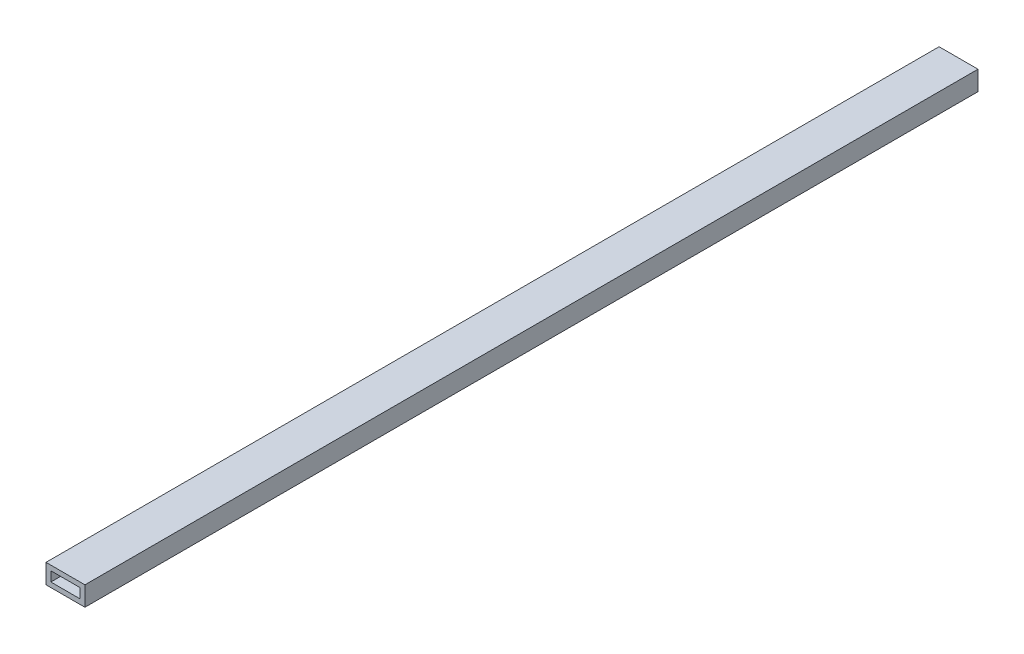
ISO-10303-21;
HEADER;
FILE_DESCRIPTION(('STEP AP214'),'2;1');
FILE_NAME('part.step','',(''),(''),'','','');
FILE_SCHEMA(('AUTOMOTIVE_DESIGN { 1 0 10303 214 1 1 1 1 }'));
ENDSEC;
DATA;
#1=APPLICATION_CONTEXT('core data for automotive mechanical design processes');
#2=APPLICATION_PROTOCOL_DEFINITION('international standard','automotive_design',2000,#1);
#3=PRODUCT_CONTEXT('',#1,'mechanical');
#4=PRODUCT('Part','Part','',(#3));
#5=PRODUCT_RELATED_PRODUCT_CATEGORY('part','',(#4));
#6=PRODUCT_DEFINITION_FORMATION('','',#4);
#7=PRODUCT_DEFINITION_CONTEXT('part definition',#1,'design');
#8=PRODUCT_DEFINITION('design','',#6,#7);
#9=PRODUCT_DEFINITION_SHAPE('','',#8);
#10=(LENGTH_UNIT() NAMED_UNIT(*) SI_UNIT(.MILLI.,.METRE.));
#11=(NAMED_UNIT(*) PLANE_ANGLE_UNIT() SI_UNIT($,.RADIAN.));
#12=(NAMED_UNIT(*) SI_UNIT($,.STERADIAN.) SOLID_ANGLE_UNIT());
#13=UNCERTAINTY_MEASURE_WITH_UNIT(LENGTH_MEASURE(1.E-05),#10,'distance_accuracy_value','');
#14=(GEOMETRIC_REPRESENTATION_CONTEXT(3) GLOBAL_UNCERTAINTY_ASSIGNED_CONTEXT((#13)) GLOBAL_UNIT_ASSIGNED_CONTEXT((#10,
#11,#12)) REPRESENTATION_CONTEXT('',''));
#15=CARTESIAN_POINT('',(0.,0.,0.));
#16=DIRECTION('',(0.,0.,1.));
#17=DIRECTION('',(1.,0.,0.));
#18=AXIS2_PLACEMENT_3D('',#15,#16,#17);
#19=CARTESIAN_POINT('',(-25.284193342889,14.9139194139194,582.676));
#20=DIRECTION('',(1.,0.,0.));
#21=DIRECTION('',(0.,0.,-1.));
#22=AXIS2_PLACEMENT_3D('',#19,#20,#21);
#23=PLANE('',#22);
#24=DIRECTION('',(0.,-1.,0.));
#25=VECTOR('',#24,1.);
#26=CARTESIAN_POINT('',(-25.284193342889,14.9139194139194,0.));
#27=LINE('',#26,#25);
#28=CARTESIAN_POINT('',(-25.284193342889,14.9139194139194,0.));
#29=VERTEX_POINT('',#28);
#30=CARTESIAN_POINT('',(-25.284193342889,2.21391941391941,0.));
#31=VERTEX_POINT('',#30);
#32=EDGE_CURVE('E130',#29,#31,#27,.T.);
#33=ORIENTED_EDGE('',*,*,#32,.T.);
#34=DIRECTION('',(0.,0.,-1.));
#35=VECTOR('',#34,1.);
#36=CARTESIAN_POINT('',(-25.284193342889,2.21391941391941,582.676));
#37=LINE('',#36,#35);
#38=CARTESIAN_POINT('',(-25.284193342889,2.21391941391941,582.676));
#39=VERTEX_POINT('',#38);
#40=EDGE_CURVE('E11',#39,#31,#37,.T.);
#41=ORIENTED_EDGE('',*,*,#40,.F.);
#42=DIRECTION('',(0.,-1.,0.));
#43=VECTOR('',#42,1.);
#44=CARTESIAN_POINT('',(-25.284193342889,14.9139194139194,582.676));
#45=LINE('',#44,#43);
#46=CARTESIAN_POINT('',(-25.284193342889,14.9139194139194,582.676));
#47=VERTEX_POINT('',#46);
#48=EDGE_CURVE('E134',#47,#39,#45,.T.);
#49=ORIENTED_EDGE('',*,*,#48,.F.);
#50=DIRECTION('',(0.,0.,-1.));
#51=VECTOR('',#50,1.);
#52=CARTESIAN_POINT('',(-25.284193342889,14.9139194139194,582.676));
#53=LINE('',#52,#51);
#54=EDGE_CURVE('E144',#47,#29,#53,.T.);
#55=ORIENTED_EDGE('',*,*,#54,.T.);
#56=EDGE_LOOP('',(#33,#41,#49,#55));
#57=FACE_BOUND('',#56,.T.);
#58=ADVANCED_FACE('F33',(#57),#23,.F.);
#59=CARTESIAN_POINT('',(-25.284193342889,2.21391941391941,582.676));
#60=DIRECTION('',(0.,1.,0.));
#61=DIRECTION('',(0.,0.,1.));
#62=AXIS2_PLACEMENT_3D('',#59,#60,#61);
#63=PLANE('',#62);
#64=DIRECTION('',(1.,0.,0.));
#65=VECTOR('',#64,1.);
#66=CARTESIAN_POINT('',(-25.284193342889,2.21391941391941,0.));
#67=LINE('',#66,#65);
#68=CARTESIAN_POINT('',(0.11580665711096,2.21391941391941,0.));
#69=VERTEX_POINT('',#68);
#70=EDGE_CURVE('E147',#31,#69,#67,.T.);
#71=ORIENTED_EDGE('',*,*,#70,.T.);
#72=DIRECTION('',(0.,0.,-1.));
#73=VECTOR('',#72,1.);
#74=CARTESIAN_POINT('',(0.11580665711096,2.21391941391941,582.676));
#75=LINE('',#74,#73);
#76=CARTESIAN_POINT('',(0.11580665711096,2.21391941391941,582.676));
#77=VERTEX_POINT('',#76);
#78=EDGE_CURVE('E40',#77,#69,#75,.T.);
#79=ORIENTED_EDGE('',*,*,#78,.F.);
#80=DIRECTION('',(1.,0.,0.));
#81=VECTOR('',#80,1.);
#82=CARTESIAN_POINT('',(-25.284193342889,2.21391941391941,582.676));
#83=LINE('',#82,#81);
#84=EDGE_CURVE('E137',#39,#77,#83,.T.);
#85=ORIENTED_EDGE('',*,*,#84,.F.);
#86=ORIENTED_EDGE('',*,*,#40,.T.);
#87=EDGE_LOOP('',(#71,#79,#85,#86));
#88=FACE_BOUND('',#87,.T.);
#89=ADVANCED_FACE('F175',(#88),#63,.F.);
#90=CARTESIAN_POINT('',(0.115806657110959,14.9139194139194,582.676));
#91=DIRECTION('',(-1.,0.,0.));
#92=DIRECTION('',(0.,-1.,0.));
#93=AXIS2_PLACEMENT_3D('',#90,#91,#92);
#94=PLANE('',#93);
#95=DIRECTION('',(0.,1.,0.));
#96=VECTOR('',#95,1.);
#97=CARTESIAN_POINT('',(0.115806657110959,14.9139194139194,0.));
#98=LINE('',#97,#96);
#99=CARTESIAN_POINT('',(0.115806657110959,14.9139194139194,0.));
#100=VERTEX_POINT('',#99);
#101=EDGE_CURVE('E149',#69,#100,#98,.T.);
#102=ORIENTED_EDGE('',*,*,#101,.T.);
#103=DIRECTION('',(0.,0.,-1.));
#104=VECTOR('',#103,1.);
#105=CARTESIAN_POINT('',(0.115806657110959,14.9139194139194,582.676));
#106=LINE('',#105,#104);
#107=CARTESIAN_POINT('',(0.115806657110959,14.9139194139194,582.676));
#108=VERTEX_POINT('',#107);
#109=EDGE_CURVE('E154',#108,#100,#106,.T.);
#110=ORIENTED_EDGE('',*,*,#109,.F.);
#111=DIRECTION('',(0.,1.,0.));
#112=VECTOR('',#111,1.);
#113=CARTESIAN_POINT('',(0.115806657110959,14.9139194139194,582.676));
#114=LINE('',#113,#112);
#115=EDGE_CURVE('E140',#77,#108,#114,.T.);
#116=ORIENTED_EDGE('',*,*,#115,.F.);
#117=ORIENTED_EDGE('',*,*,#78,.T.);
#118=EDGE_LOOP('',(#102,#110,#116,#117));
#119=FACE_BOUND('',#118,.T.);
#120=ADVANCED_FACE('F161',(#119),#94,.F.);
#121=CARTESIAN_POINT('',(-25.284193342889,14.9139194139194,582.676));
#122=DIRECTION('',(0.,-1.,0.));
#123=DIRECTION('',(0.,0.,-1.));
#124=AXIS2_PLACEMENT_3D('',#121,#122,#123);
#125=PLANE('',#124);
#126=DIRECTION('',(-1.,0.,0.));
#127=VECTOR('',#126,1.);
#128=CARTESIAN_POINT('',(-25.284193342889,14.9139194139194,0.));
#129=LINE('',#128,#127);
#130=EDGE_CURVE('E138',#100,#29,#129,.T.);
#131=ORIENTED_EDGE('',*,*,#130,.T.);
#132=ORIENTED_EDGE('',*,*,#54,.F.);
#133=DIRECTION('',(-1.,0.,0.));
#134=VECTOR('',#133,1.);
#135=CARTESIAN_POINT('',(-25.284193342889,14.9139194139194,582.676));
#136=LINE('',#135,#134);
#137=EDGE_CURVE('E142',#108,#47,#136,.T.);
#138=ORIENTED_EDGE('',*,*,#137,.F.);
#139=ORIENTED_EDGE('',*,*,#109,.T.);
#140=EDGE_LOOP('',(#131,#132,#138,#139));
#141=FACE_BOUND('',#140,.T.);
#142=ADVANCED_FACE('F170',(#141),#125,.F.);
#143=CARTESIAN_POINT('',(0.,0.,582.676));
#144=DIRECTION('',(0.,0.,1.));
#145=DIRECTION('',(1.,0.,0.));
#146=AXIS2_PLACEMENT_3D('',#143,#144,#145);
#147=PLANE('',#146);
#148=DIRECTION('',(-1.,0.,0.));
#149=VECTOR('',#148,1.);
#150=CARTESIAN_POINT('',(-3.05919334288904,5.38891941391941,582.676));
#151=LINE('',#150,#149);
#152=CARTESIAN_POINT('',(-3.05919334288904,5.38891941391941,582.676));
#153=VERTEX_POINT('',#152);
#154=CARTESIAN_POINT('',(-22.109193342889,5.38891941391941,582.676));
#155=VERTEX_POINT('',#154);
#156=EDGE_CURVE('E99',#153,#155,#151,.T.);
#157=ORIENTED_EDGE('',*,*,#156,.T.);
#158=DIRECTION('',(0.,1.,0.));
#159=VECTOR('',#158,1.);
#160=CARTESIAN_POINT('',(-22.109193342889,5.38891941391941,582.676));
#161=LINE('',#160,#159);
#162=CARTESIAN_POINT('',(-22.109193342889,11.7389194139194,582.676));
#163=VERTEX_POINT('',#162);
#164=EDGE_CURVE('E108',#155,#163,#161,.T.);
#165=ORIENTED_EDGE('',*,*,#164,.T.);
#166=DIRECTION('',(1.,0.,0.));
#167=VECTOR('',#166,1.);
#168=CARTESIAN_POINT('',(-22.109193342889,11.7389194139194,582.676));
#169=LINE('',#168,#167);
#170=CARTESIAN_POINT('',(-3.05919334288904,11.7389194139194,582.676));
#171=VERTEX_POINT('',#170);
#172=EDGE_CURVE('E47',#163,#171,#169,.T.);
#173=ORIENTED_EDGE('',*,*,#172,.T.);
#174=DIRECTION('',(0.,-1.,0.));
#175=VECTOR('',#174,1.);
#176=CARTESIAN_POINT('',(-3.05919334288904,11.7389194139194,582.676));
#177=LINE('',#176,#175);
#178=EDGE_CURVE('E105',#171,#153,#177,.T.);
#179=ORIENTED_EDGE('',*,*,#178,.T.);
#180=EDGE_LOOP('',(#157,#165,#173,#179));
#181=FACE_BOUND('',#180,.T.);
#182=ORIENTED_EDGE('',*,*,#48,.T.);
#183=ORIENTED_EDGE('',*,*,#84,.T.);
#184=ORIENTED_EDGE('',*,*,#115,.T.);
#185=ORIENTED_EDGE('',*,*,#137,.T.);
#186=EDGE_LOOP('',(#182,#183,#184,#185));
#187=FACE_BOUND('',#186,.T.);
#188=ADVANCED_FACE('F112',(#181,#187),#147,.T.);
#189=CARTESIAN_POINT('',(0.,0.,0.));
#190=DIRECTION('',(0.,0.,1.));
#191=DIRECTION('',(1.,0.,0.));
#192=AXIS2_PLACEMENT_3D('',#189,#190,#191);
#193=PLANE('',#192);
#194=DIRECTION('',(0.,1.,0.));
#195=VECTOR('',#194,1.);
#196=CARTESIAN_POINT('',(-22.109193342889,5.38891941391941,0.));
#197=LINE('',#196,#195);
#198=CARTESIAN_POINT('',(-22.109193342889,5.38891941391941,0.));
#199=VERTEX_POINT('',#198);
#200=CARTESIAN_POINT('',(-22.109193342889,11.7389194139194,0.));
#201=VERTEX_POINT('',#200);
#202=EDGE_CURVE('E124',#199,#201,#197,.T.);
#203=ORIENTED_EDGE('',*,*,#202,.F.);
#204=DIRECTION('',(-1.,0.,0.));
#205=VECTOR('',#204,1.);
#206=CARTESIAN_POINT('',(-3.05919334288904,5.38891941391941,0.));
#207=LINE('',#206,#205);
#208=CARTESIAN_POINT('',(-3.05919334288904,5.38891941391941,0.));
#209=VERTEX_POINT('',#208);
#210=EDGE_CURVE('E55',#209,#199,#207,.T.);
#211=ORIENTED_EDGE('',*,*,#210,.F.);
#212=DIRECTION('',(0.,-1.,0.));
#213=VECTOR('',#212,1.);
#214=CARTESIAN_POINT('',(-3.05919334288904,11.7389194139194,0.));
#215=LINE('',#214,#213);
#216=CARTESIAN_POINT('',(-3.05919334288904,11.7389194139194,0.));
#217=VERTEX_POINT('',#216);
#218=EDGE_CURVE('E115',#217,#209,#215,.T.);
#219=ORIENTED_EDGE('',*,*,#218,.F.);
#220=DIRECTION('',(1.,0.,0.));
#221=VECTOR('',#220,1.);
#222=CARTESIAN_POINT('',(-22.109193342889,11.7389194139194,0.));
#223=LINE('',#222,#221);
#224=EDGE_CURVE('E118',#201,#217,#223,.T.);
#225=ORIENTED_EDGE('',*,*,#224,.F.);
#226=EDGE_LOOP('',(#203,#211,#219,#225));
#227=FACE_BOUND('',#226,.T.);
#228=ORIENTED_EDGE('',*,*,#32,.F.);
#229=ORIENTED_EDGE('',*,*,#130,.F.);
#230=ORIENTED_EDGE('',*,*,#101,.F.);
#231=ORIENTED_EDGE('',*,*,#70,.F.);
#232=EDGE_LOOP('',(#228,#229,#230,#231));
#233=FACE_BOUND('',#232,.T.);
#234=ADVANCED_FACE('F167',(#227,#233),#193,.F.);
#235=CARTESIAN_POINT('',(-3.05919334288904,5.38891941391941,582.676));
#236=DIRECTION('',(0.,-1.,0.));
#237=DIRECTION('',(0.,0.,-1.));
#238=AXIS2_PLACEMENT_3D('',#235,#236,#237);
#239=PLANE('',#238);
#240=ORIENTED_EDGE('',*,*,#210,.T.);
#241=DIRECTION('',(0.,0.,-1.));
#242=VECTOR('',#241,1.);
#243=CARTESIAN_POINT('',(-22.109193342889,5.38891941391941,582.676));
#244=LINE('',#243,#242);
#245=EDGE_CURVE('E95',#155,#199,#244,.T.);
#246=ORIENTED_EDGE('',*,*,#245,.F.);
#247=ORIENTED_EDGE('',*,*,#156,.F.);
#248=DIRECTION('',(0.,0.,-1.));
#249=VECTOR('',#248,1.);
#250=CARTESIAN_POINT('',(-3.05919334288904,5.38891941391941,582.676));
#251=LINE('',#250,#249);
#252=EDGE_CURVE('E128',#153,#209,#251,.T.);
#253=ORIENTED_EDGE('',*,*,#252,.T.);
#254=EDGE_LOOP('',(#240,#246,#247,#253));
#255=FACE_BOUND('',#254,.T.);
#256=ADVANCED_FACE('F97',(#255),#239,.F.);
#257=CARTESIAN_POINT('',(-3.05919334288904,11.7389194139194,582.676));
#258=DIRECTION('',(1.,0.,0.));
#259=DIRECTION('',(0.,1.,0.));
#260=AXIS2_PLACEMENT_3D('',#257,#258,#259);
#261=PLANE('',#260);
#262=ORIENTED_EDGE('',*,*,#218,.T.);
#263=ORIENTED_EDGE('',*,*,#252,.F.);
#264=ORIENTED_EDGE('',*,*,#178,.F.);
#265=DIRECTION('',(0.,0.,-1.));
#266=VECTOR('',#265,1.);
#267=CARTESIAN_POINT('',(-3.05919334288904,11.7389194139194,582.676));
#268=LINE('',#267,#266);
#269=EDGE_CURVE('E131',#171,#217,#268,.T.);
#270=ORIENTED_EDGE('',*,*,#269,.T.);
#271=EDGE_LOOP('',(#262,#263,#264,#270));
#272=FACE_BOUND('',#271,.T.);
#273=ADVANCED_FACE('F192',(#272),#261,.F.);
#274=CARTESIAN_POINT('',(-22.109193342889,11.7389194139194,582.676));
#275=DIRECTION('',(0.,1.,0.));
#276=DIRECTION('',(0.,0.,1.));
#277=AXIS2_PLACEMENT_3D('',#274,#275,#276);
#278=PLANE('',#277);
#279=ORIENTED_EDGE('',*,*,#224,.T.);
#280=ORIENTED_EDGE('',*,*,#269,.F.);
#281=ORIENTED_EDGE('',*,*,#172,.F.);
#282=DIRECTION('',(0.,0.,-1.));
#283=VECTOR('',#282,1.);
#284=CARTESIAN_POINT('',(-22.109193342889,11.7389194139194,582.676));
#285=LINE('',#284,#283);
#286=EDGE_CURVE('E104',#163,#201,#285,.T.);
#287=ORIENTED_EDGE('',*,*,#286,.T.);
#288=EDGE_LOOP('',(#279,#280,#281,#287));
#289=FACE_BOUND('',#288,.T.);
#290=ADVANCED_FACE('F195',(#289),#278,.F.);
#291=CARTESIAN_POINT('',(-22.109193342889,5.38891941391941,582.676));
#292=DIRECTION('',(-1.,0.,0.));
#293=DIRECTION('',(0.,0.,1.));
#294=AXIS2_PLACEMENT_3D('',#291,#292,#293);
#295=PLANE('',#294);
#296=ORIENTED_EDGE('',*,*,#202,.T.);
#297=ORIENTED_EDGE('',*,*,#286,.F.);
#298=ORIENTED_EDGE('',*,*,#164,.F.);
#299=ORIENTED_EDGE('',*,*,#245,.T.);
#300=EDGE_LOOP('',(#296,#297,#298,#299));
#301=FACE_BOUND('',#300,.T.);
#302=ADVANCED_FACE('F109',(#301),#295,.F.);
#303=CLOSED_SHELL('',(#58,#89,#120,#142,#188,#234,#256,#273,#290,#302));
#304=MANIFOLD_SOLID_BREP('B2',#303);
#305=ADVANCED_BREP_SHAPE_REPRESENTATION('',(#18,#304),#14);
#306=SHAPE_DEFINITION_REPRESENTATION(#9,#305);
ENDSEC;
END-ISO-10303-21;
